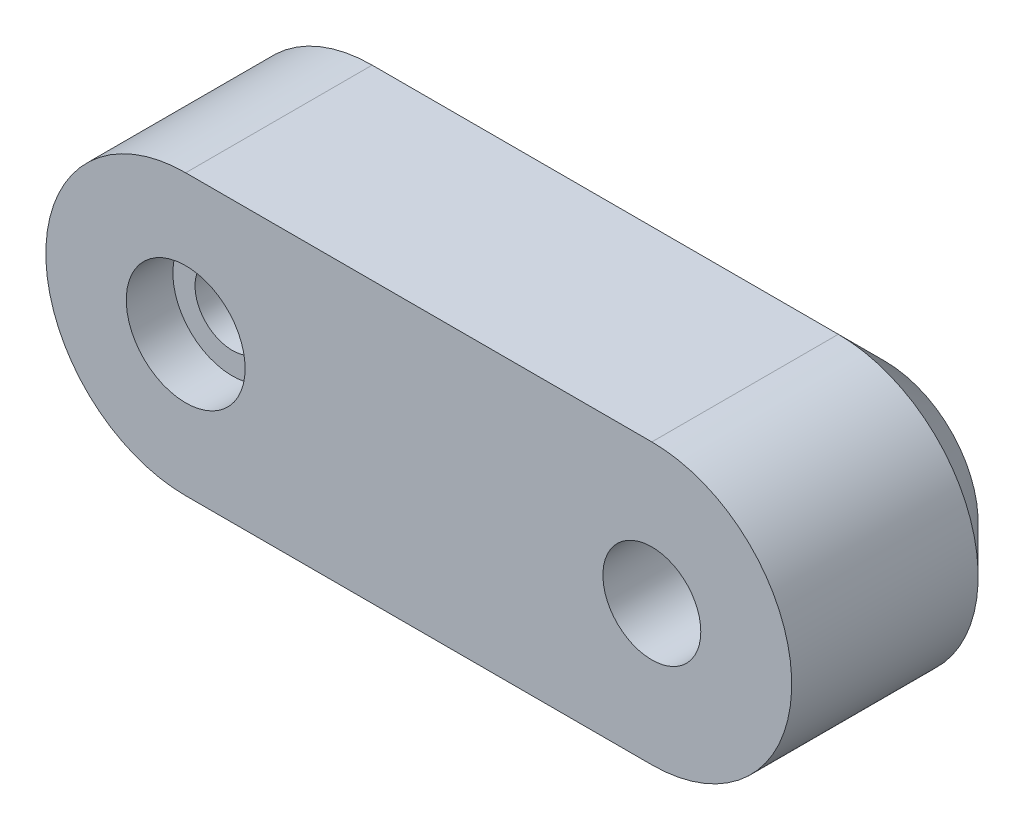
ISO-10303-21;
HEADER;
FILE_DESCRIPTION(('STEP AP214'),'2;1');
FILE_NAME('part.step','',(''),(''),'','','');
FILE_SCHEMA(('AUTOMOTIVE_DESIGN { 1 0 10303 214 1 1 1 1 }'));
ENDSEC;
DATA;
#1=APPLICATION_CONTEXT('core data for automotive mechanical design processes');
#2=APPLICATION_PROTOCOL_DEFINITION('international standard','automotive_design',2000,#1);
#3=PRODUCT_CONTEXT('',#1,'mechanical');
#4=PRODUCT('Part','Part','',(#3));
#5=PRODUCT_RELATED_PRODUCT_CATEGORY('part','',(#4));
#6=PRODUCT_DEFINITION_FORMATION('','',#4);
#7=PRODUCT_DEFINITION_CONTEXT('part definition',#1,'design');
#8=PRODUCT_DEFINITION('design','',#6,#7);
#9=PRODUCT_DEFINITION_SHAPE('','',#8);
#10=(LENGTH_UNIT() NAMED_UNIT(*) SI_UNIT(.MILLI.,.METRE.));
#11=(NAMED_UNIT(*) PLANE_ANGLE_UNIT() SI_UNIT($,.RADIAN.));
#12=(NAMED_UNIT(*) SI_UNIT($,.STERADIAN.) SOLID_ANGLE_UNIT());
#13=UNCERTAINTY_MEASURE_WITH_UNIT(LENGTH_MEASURE(1.E-05),#10,'distance_accuracy_value','');
#14=(GEOMETRIC_REPRESENTATION_CONTEXT(3) GLOBAL_UNCERTAINTY_ASSIGNED_CONTEXT((#13)) GLOBAL_UNIT_ASSIGNED_CONTEXT((#10,
#11,#12)) REPRESENTATION_CONTEXT('',''));
#15=CARTESIAN_POINT('',(0.,0.,0.));
#16=DIRECTION('',(0.,0.,1.));
#17=DIRECTION('',(1.,0.,0.));
#18=AXIS2_PLACEMENT_3D('',#15,#16,#17);
#19=CARTESIAN_POINT('',(20.,0.,10.));
#20=DIRECTION('',(0.,0.,1.));
#21=DIRECTION('',(1.,0.,0.));
#22=AXIS2_PLACEMENT_3D('',#19,#20,#21);
#23=CYLINDRICAL_SURFACE('',#22,2.58);
#24=CARTESIAN_POINT('',(20.,0.,5.));
#25=DIRECTION('',(0.,0.,1.));
#26=DIRECTION('',(1.,0.,0.));
#27=AXIS2_PLACEMENT_3D('',#24,#25,#26);
#28=CIRCLE('',#27,2.58);
#29=CARTESIAN_POINT('',(22.58,0.,5.));
#30=VERTEX_POINT('',#29);
#31=EDGE_CURVE('E185',#30,#30,#28,.T.);
#32=ORIENTED_EDGE('',*,*,#31,.T.);
#33=EDGE_LOOP('',(#32));
#34=FACE_BOUND('',#33,.T.);
#35=CARTESIAN_POINT('',(20.,0.,4.));
#36=DIRECTION('',(0.,0.,-1.));
#37=DIRECTION('',(-1.,0.,0.));
#38=AXIS2_PLACEMENT_3D('',#35,#36,#37);
#39=CIRCLE('',#38,2.58);
#40=CARTESIAN_POINT('',(17.42,0.,4.));
#41=VERTEX_POINT('',#40);
#42=EDGE_CURVE('E37',#41,#41,#39,.T.);
#43=ORIENTED_EDGE('',*,*,#42,.T.);
#44=EDGE_LOOP('',(#43));
#45=FACE_BOUND('',#44,.T.);
#46=ADVANCED_FACE('F33',(#34,#45),#23,.F.);
#47=CARTESIAN_POINT('',(0.,0.,10.));
#48=DIRECTION('',(0.,0.,-1.));
#49=DIRECTION('',(-1.,0.,0.));
#50=AXIS2_PLACEMENT_3D('',#47,#48,#49);
#51=CYLINDRICAL_SURFACE('',#50,6.);
#52=DIRECTION('',(0.,0.,-1.));
#53=VECTOR('',#52,1.);
#54=CARTESIAN_POINT('',(0.,6.,10.));
#55=LINE('',#54,#53);
#56=CARTESIAN_POINT('',(0.,6.,10.));
#57=VERTEX_POINT('',#56);
#58=CARTESIAN_POINT('',(0.,6.,2.00000000000001));
#59=VERTEX_POINT('',#58);
#60=EDGE_CURVE('E215',#57,#59,#55,.T.);
#61=ORIENTED_EDGE('',*,*,#60,.T.);
#62=CARTESIAN_POINT('',(0.,0.,2.00000000000001));
#63=DIRECTION('',(0.,0.,1.));
#64=DIRECTION('',(1.,0.,0.));
#65=AXIS2_PLACEMENT_3D('',#62,#63,#64);
#66=CIRCLE('',#65,6.);
#67=CARTESIAN_POINT('',(0.,-6.,2.00000000000001));
#68=VERTEX_POINT('',#67);
#69=EDGE_CURVE('E237',#59,#68,#66,.T.);
#70=ORIENTED_EDGE('',*,*,#69,.T.);
#71=DIRECTION('',(0.,0.,-1.));
#72=VECTOR('',#71,1.);
#73=CARTESIAN_POINT('',(0.,-6.,10.));
#74=LINE('',#73,#72);
#75=CARTESIAN_POINT('',(0.,-6.,10.));
#76=VERTEX_POINT('',#75);
#77=EDGE_CURVE('E223',#76,#68,#74,.T.);
#78=ORIENTED_EDGE('',*,*,#77,.F.);
#79=CARTESIAN_POINT('',(0.,0.,10.));
#80=DIRECTION('',(0.,0.,1.));
#81=DIRECTION('',(1.,0.,0.));
#82=AXIS2_PLACEMENT_3D('',#79,#80,#81);
#83=CIRCLE('',#82,6.);
#84=EDGE_CURVE('E206',#57,#76,#83,.T.);
#85=ORIENTED_EDGE('',*,*,#84,.F.);
#86=EDGE_LOOP('',(#61,#70,#78,#85));
#87=FACE_BOUND('',#86,.T.);
#88=ADVANCED_FACE('F276',(#87),#51,.T.);
#89=CARTESIAN_POINT('',(0.,-6.,10.));
#90=DIRECTION('',(0.,1.,0.));
#91=DIRECTION('',(-1.,0.,0.));
#92=AXIS2_PLACEMENT_3D('',#89,#90,#91);
#93=PLANE('',#92);
#94=ORIENTED_EDGE('',*,*,#77,.T.);
#95=DIRECTION('',(1.,0.,0.));
#96=VECTOR('',#95,1.);
#97=CARTESIAN_POINT('',(0.,-6.,2.00000000000001));
#98=LINE('',#97,#96);
#99=CARTESIAN_POINT('',(20.,-6.,2.00000000000001));
#100=VERTEX_POINT('',#99);
#101=EDGE_CURVE('E11',#68,#100,#98,.T.);
#102=ORIENTED_EDGE('',*,*,#101,.T.);
#103=DIRECTION('',(0.,0.,-1.));
#104=VECTOR('',#103,1.);
#105=CARTESIAN_POINT('',(20.,-6.,10.));
#106=LINE('',#105,#104);
#107=CARTESIAN_POINT('',(20.,-6.,10.));
#108=VERTEX_POINT('',#107);
#109=EDGE_CURVE('E221',#108,#100,#106,.T.);
#110=ORIENTED_EDGE('',*,*,#109,.F.);
#111=DIRECTION('',(1.,0.,0.));
#112=VECTOR('',#111,1.);
#113=CARTESIAN_POINT('',(0.,-6.,10.));
#114=LINE('',#113,#112);
#115=EDGE_CURVE('E209',#76,#108,#114,.T.);
#116=ORIENTED_EDGE('',*,*,#115,.F.);
#117=EDGE_LOOP('',(#94,#102,#110,#116));
#118=FACE_BOUND('',#117,.T.);
#119=ADVANCED_FACE('F282',(#118),#93,.F.);
#120=CARTESIAN_POINT('',(20.,0.,10.));
#121=DIRECTION('',(0.,0.,-1.));
#122=DIRECTION('',(-1.,0.,0.));
#123=AXIS2_PLACEMENT_3D('',#120,#121,#122);
#124=CYLINDRICAL_SURFACE('',#123,6.);
#125=ORIENTED_EDGE('',*,*,#109,.T.);
#126=CARTESIAN_POINT('',(20.,0.,2.00000000000001));
#127=DIRECTION('',(0.,0.,1.));
#128=DIRECTION('',(1.,0.,0.));
#129=AXIS2_PLACEMENT_3D('',#126,#127,#128);
#130=CIRCLE('',#129,6.);
#131=CARTESIAN_POINT('',(20.,6.,2.00000000000001));
#132=VERTEX_POINT('',#131);
#133=EDGE_CURVE('E42',#100,#132,#130,.T.);
#134=ORIENTED_EDGE('',*,*,#133,.T.);
#135=DIRECTION('',(0.,0.,-1.));
#136=VECTOR('',#135,1.);
#137=CARTESIAN_POINT('',(20.,6.,10.));
#138=LINE('',#137,#136);
#139=CARTESIAN_POINT('',(20.,6.,10.));
#140=VERTEX_POINT('',#139);
#141=EDGE_CURVE('E218',#140,#132,#138,.T.);
#142=ORIENTED_EDGE('',*,*,#141,.F.);
#143=CARTESIAN_POINT('',(20.,0.,10.));
#144=DIRECTION('',(0.,0.,1.));
#145=DIRECTION('',(1.,0.,0.));
#146=AXIS2_PLACEMENT_3D('',#143,#144,#145);
#147=CIRCLE('',#146,6.);
#148=EDGE_CURVE('E211',#108,#140,#147,.T.);
#149=ORIENTED_EDGE('',*,*,#148,.F.);
#150=EDGE_LOOP('',(#125,#134,#142,#149));
#151=FACE_BOUND('',#150,.T.);
#152=ADVANCED_FACE('F281',(#151),#124,.T.);
#153=CARTESIAN_POINT('',(0.,6.,10.));
#154=DIRECTION('',(0.,-1.,0.));
#155=DIRECTION('',(1.,0.,0.));
#156=AXIS2_PLACEMENT_3D('',#153,#154,#155);
#157=PLANE('',#156);
#158=ORIENTED_EDGE('',*,*,#141,.T.);
#159=DIRECTION('',(-1.,0.,0.));
#160=VECTOR('',#159,1.);
#161=CARTESIAN_POINT('',(0.,6.,2.00000000000001));
#162=LINE('',#161,#160);
#163=EDGE_CURVE('E225',#132,#59,#162,.T.);
#164=ORIENTED_EDGE('',*,*,#163,.T.);
#165=ORIENTED_EDGE('',*,*,#60,.F.);
#166=DIRECTION('',(-1.,0.,0.));
#167=VECTOR('',#166,1.);
#168=CARTESIAN_POINT('',(0.,6.,10.));
#169=LINE('',#168,#167);
#170=EDGE_CURVE('E213',#140,#57,#169,.T.);
#171=ORIENTED_EDGE('',*,*,#170,.F.);
#172=EDGE_LOOP('',(#158,#164,#165,#171));
#173=FACE_BOUND('',#172,.T.);
#174=ADVANCED_FACE('F272',(#173),#157,.F.);
#175=CARTESIAN_POINT('',(0.,0.,10.));
#176=DIRECTION('',(0.,0.,1.));
#177=DIRECTION('',(1.,0.,0.));
#178=AXIS2_PLACEMENT_3D('',#175,#176,#177);
#179=PLANE('',#178);
#180=CARTESIAN_POINT('',(20.,0.,10.));
#181=DIRECTION('',(0.,0.,1.));
#182=DIRECTION('',(1.,0.,0.));
#183=AXIS2_PLACEMENT_3D('',#180,#181,#182);
#184=CIRCLE('',#183,2.1);
#185=CARTESIAN_POINT('',(22.1,0.,10.));
#186=VERTEX_POINT('',#185);
#187=EDGE_CURVE('E178',#186,#186,#184,.T.);
#188=ORIENTED_EDGE('',*,*,#187,.F.);
#189=EDGE_LOOP('',(#188));
#190=FACE_BOUND('',#189,.T.);
#191=CARTESIAN_POINT('',(0.,0.,10.));
#192=DIRECTION('',(0.,0.,1.));
#193=DIRECTION('',(1.,0.,0.));
#194=AXIS2_PLACEMENT_3D('',#191,#192,#193);
#195=CIRCLE('',#194,2.55);
#196=CARTESIAN_POINT('',(2.55,0.,10.));
#197=VERTEX_POINT('',#196);
#198=EDGE_CURVE('E188',#197,#197,#195,.T.);
#199=ORIENTED_EDGE('',*,*,#198,.F.);
#200=EDGE_LOOP('',(#199));
#201=FACE_BOUND('',#200,.T.);
#202=ORIENTED_EDGE('',*,*,#84,.T.);
#203=ORIENTED_EDGE('',*,*,#115,.T.);
#204=ORIENTED_EDGE('',*,*,#148,.T.);
#205=ORIENTED_EDGE('',*,*,#170,.T.);
#206=EDGE_LOOP('',(#202,#203,#204,#205));
#207=FACE_BOUND('',#206,.T.);
#208=ADVANCED_FACE('F278',(#190,#201,#207),#179,.T.);
#209=CARTESIAN_POINT('',(0.,0.,0.));
#210=DIRECTION('',(0.,0.,1.));
#211=DIRECTION('',(1.,0.,0.));
#212=AXIS2_PLACEMENT_3D('',#209,#210,#211);
#213=PLANE('',#212);
#214=DIRECTION('',(-0.5,-0.866025403784438,0.));
#215=VECTOR('',#214,1.);
#216=CARTESIAN_POINT('',(23.3486315612998,0.,0.));
#217=LINE('',#216,#215);
#218=CARTESIAN_POINT('',(23.3486315612998,0.,0.));
#219=VERTEX_POINT('',#218);
#220=CARTESIAN_POINT('',(21.6743157806499,-2.9,0.));
#221=VERTEX_POINT('',#220);
#222=EDGE_CURVE('E159',#219,#221,#217,.T.);
#223=ORIENTED_EDGE('',*,*,#222,.F.);
#224=DIRECTION('',(0.500000000000001,-0.866025403784438,0.));
#225=VECTOR('',#224,1.);
#226=CARTESIAN_POINT('',(21.6743157806499,2.9,0.));
#227=LINE('',#226,#225);
#228=CARTESIAN_POINT('',(21.6743157806499,2.9,0.));
#229=VERTEX_POINT('',#228);
#230=EDGE_CURVE('E50',#229,#219,#227,.T.);
#231=ORIENTED_EDGE('',*,*,#230,.F.);
#232=DIRECTION('',(1.,0.,0.));
#233=VECTOR('',#232,1.);
#234=CARTESIAN_POINT('',(18.3256842193501,2.9,0.));
#235=LINE('',#234,#233);
#236=CARTESIAN_POINT('',(18.3256842193501,2.9,0.));
#237=VERTEX_POINT('',#236);
#238=EDGE_CURVE('E145',#237,#229,#235,.T.);
#239=ORIENTED_EDGE('',*,*,#238,.F.);
#240=DIRECTION('',(0.5,0.866025403784439,0.));
#241=VECTOR('',#240,1.);
#242=CARTESIAN_POINT('',(16.6513684387002,0.,0.));
#243=LINE('',#242,#241);
#244=CARTESIAN_POINT('',(16.6513684387002,0.,0.));
#245=VERTEX_POINT('',#244);
#246=EDGE_CURVE('E148',#245,#237,#243,.T.);
#247=ORIENTED_EDGE('',*,*,#246,.F.);
#248=DIRECTION('',(-0.5,0.866025403784438,0.));
#249=VECTOR('',#248,1.);
#250=CARTESIAN_POINT('',(18.3256842193501,-2.9,0.));
#251=LINE('',#250,#249);
#252=CARTESIAN_POINT('',(18.3256842193501,-2.9,0.));
#253=VERTEX_POINT('',#252);
#254=EDGE_CURVE('E164',#253,#245,#251,.T.);
#255=ORIENTED_EDGE('',*,*,#254,.F.);
#256=DIRECTION('',(-1.,0.,0.));
#257=VECTOR('',#256,1.);
#258=CARTESIAN_POINT('',(21.6743157806499,-2.9,0.));
#259=LINE('',#258,#257);
#260=EDGE_CURVE('E161',#221,#253,#259,.T.);
#261=ORIENTED_EDGE('',*,*,#260,.F.);
#262=EDGE_LOOP('',(#223,#231,#239,#247,#255,#261));
#263=FACE_BOUND('',#262,.T.);
#264=CARTESIAN_POINT('',(0.,0.,0.));
#265=DIRECTION('',(0.,0.,1.));
#266=DIRECTION('',(1.,0.,0.));
#267=AXIS2_PLACEMENT_3D('',#264,#265,#266);
#268=CIRCLE('',#267,4.);
#269=CARTESIAN_POINT('',(0.,-4.,0.));
#270=VERTEX_POINT('',#269);
#271=CARTESIAN_POINT('',(0.,4.,0.));
#272=VERTEX_POINT('',#271);
#273=EDGE_CURVE('E232',#270,#272,#268,.F.);
#274=ORIENTED_EDGE('',*,*,#273,.T.);
#275=DIRECTION('',(1.,0.,0.));
#276=VECTOR('',#275,1.);
#277=CARTESIAN_POINT('',(0.,4.,0.));
#278=LINE('',#277,#276);
#279=CARTESIAN_POINT('',(20.,4.,0.));
#280=VERTEX_POINT('',#279);
#281=EDGE_CURVE('E234',#272,#280,#278,.T.);
#282=ORIENTED_EDGE('',*,*,#281,.T.);
#283=CARTESIAN_POINT('',(20.,0.,0.));
#284=DIRECTION('',(0.,0.,1.));
#285=DIRECTION('',(1.,0.,0.));
#286=AXIS2_PLACEMENT_3D('',#283,#284,#285);
#287=CIRCLE('',#286,4.);
#288=CARTESIAN_POINT('',(20.,-4.,0.));
#289=VERTEX_POINT('',#288);
#290=EDGE_CURVE('E230',#280,#289,#287,.F.);
#291=ORIENTED_EDGE('',*,*,#290,.T.);
#292=DIRECTION('',(-1.,0.,0.));
#293=VECTOR('',#292,1.);
#294=CARTESIAN_POINT('',(0.,-4.,0.));
#295=LINE('',#294,#293);
#296=EDGE_CURVE('E228',#289,#270,#295,.T.);
#297=ORIENTED_EDGE('',*,*,#296,.T.);
#298=EDGE_LOOP('',(#274,#282,#291,#297));
#299=FACE_BOUND('',#298,.T.);
#300=CARTESIAN_POINT('',(0.,0.,0.));
#301=DIRECTION('',(0.,0.,1.));
#302=DIRECTION('',(1.,0.,0.));
#303=AXIS2_PLACEMENT_3D('',#300,#301,#302);
#304=CIRCLE('',#303,2.55);
#305=CARTESIAN_POINT('',(2.55,0.,0.));
#306=VERTEX_POINT('',#305);
#307=EDGE_CURVE('E203',#306,#306,#304,.T.);
#308=ORIENTED_EDGE('',*,*,#307,.T.);
#309=EDGE_LOOP('',(#308));
#310=FACE_BOUND('',#309,.T.);
#311=ADVANCED_FACE('F258',(#263,#299,#310),#213,.F.);
#312=CARTESIAN_POINT('',(0.,0.,10.));
#313=DIRECTION('',(0.,0.,1.));
#314=DIRECTION('',(1.,0.,0.));
#315=AXIS2_PLACEMENT_3D('',#312,#313,#314);
#316=CYLINDRICAL_SURFACE('',#315,2.55);
#317=CARTESIAN_POINT('',(0.,0.,5.));
#318=DIRECTION('',(0.,0.,1.));
#319=DIRECTION('',(1.,0.,0.));
#320=AXIS2_PLACEMENT_3D('',#317,#318,#319);
#321=CIRCLE('',#320,2.55);
#322=CARTESIAN_POINT('',(2.55,0.,5.));
#323=VERTEX_POINT('',#322);
#324=EDGE_CURVE('E200',#323,#323,#321,.T.);
#325=ORIENTED_EDGE('',*,*,#324,.T.);
#326=EDGE_LOOP('',(#325));
#327=FACE_BOUND('',#326,.T.);
#328=ORIENTED_EDGE('',*,*,#307,.F.);
#329=EDGE_LOOP('',(#328));
#330=FACE_BOUND('',#329,.T.);
#331=ADVANCED_FACE('F316',(#327,#330),#316,.F.);
#332=CARTESIAN_POINT('',(-2.55,0.,5.));
#333=DIRECTION('',(0.,0.,-1.));
#334=DIRECTION('',(-1.,0.,0.));
#335=AXIS2_PLACEMENT_3D('',#332,#333,#334);
#336=PLANE('',#335);
#337=CARTESIAN_POINT('',(0.,0.,5.));
#338=DIRECTION('',(0.,0.,1.));
#339=DIRECTION('',(1.,0.,0.));
#340=AXIS2_PLACEMENT_3D('',#337,#338,#339);
#341=CIRCLE('',#340,1.6);
#342=CARTESIAN_POINT('',(1.6,0.,5.));
#343=VERTEX_POINT('',#342);
#344=EDGE_CURVE('E197',#343,#343,#341,.T.);
#345=ORIENTED_EDGE('',*,*,#344,.T.);
#346=EDGE_LOOP('',(#345));
#347=FACE_BOUND('',#346,.T.);
#348=ORIENTED_EDGE('',*,*,#324,.F.);
#349=EDGE_LOOP('',(#348));
#350=FACE_BOUND('',#349,.T.);
#351=ADVANCED_FACE('F312',(#347,#350),#336,.T.);
#352=CARTESIAN_POINT('',(0.,0.,10.));
#353=DIRECTION('',(0.,0.,1.));
#354=DIRECTION('',(1.,0.,0.));
#355=AXIS2_PLACEMENT_3D('',#352,#353,#354);
#356=CYLINDRICAL_SURFACE('',#355,1.6);
#357=CARTESIAN_POINT('',(0.,0.,8.));
#358=DIRECTION('',(0.,0.,1.));
#359=DIRECTION('',(1.,0.,0.));
#360=AXIS2_PLACEMENT_3D('',#357,#358,#359);
#361=CIRCLE('',#360,1.6);
#362=CARTESIAN_POINT('',(1.6,0.,8.));
#363=VERTEX_POINT('',#362);
#364=EDGE_CURVE('E194',#363,#363,#361,.T.);
#365=ORIENTED_EDGE('',*,*,#364,.T.);
#366=EDGE_LOOP('',(#365));
#367=FACE_BOUND('',#366,.T.);
#368=ORIENTED_EDGE('',*,*,#344,.F.);
#369=EDGE_LOOP('',(#368));
#370=FACE_BOUND('',#369,.T.);
#371=ADVANCED_FACE('F308',(#367,#370),#356,.F.);
#372=CARTESIAN_POINT('',(-1.6,0.,8.));
#373=DIRECTION('',(0.,0.,1.));
#374=DIRECTION('',(1.,0.,0.));
#375=AXIS2_PLACEMENT_3D('',#372,#373,#374);
#376=PLANE('',#375);
#377=CARTESIAN_POINT('',(0.,0.,8.));
#378=DIRECTION('',(0.,0.,1.));
#379=DIRECTION('',(1.,0.,0.));
#380=AXIS2_PLACEMENT_3D('',#377,#378,#379);
#381=CIRCLE('',#380,2.55);
#382=CARTESIAN_POINT('',(2.55,0.,8.));
#383=VERTEX_POINT('',#382);
#384=EDGE_CURVE('E191',#383,#383,#381,.T.);
#385=ORIENTED_EDGE('',*,*,#384,.T.);
#386=EDGE_LOOP('',(#385));
#387=FACE_BOUND('',#386,.T.);
#388=ORIENTED_EDGE('',*,*,#364,.F.);
#389=EDGE_LOOP('',(#388));
#390=FACE_BOUND('',#389,.T.);
#391=ADVANCED_FACE('F304',(#387,#390),#376,.T.);
#392=CARTESIAN_POINT('',(0.,0.,10.));
#393=DIRECTION('',(0.,0.,1.));
#394=DIRECTION('',(1.,0.,0.));
#395=AXIS2_PLACEMENT_3D('',#392,#393,#394);
#396=CYLINDRICAL_SURFACE('',#395,2.55);
#397=ORIENTED_EDGE('',*,*,#198,.T.);
#398=EDGE_LOOP('',(#397));
#399=FACE_BOUND('',#398,.T.);
#400=ORIENTED_EDGE('',*,*,#384,.F.);
#401=EDGE_LOOP('',(#400));
#402=FACE_BOUND('',#401,.T.);
#403=ADVANCED_FACE('F301',(#399,#402),#396,.F.);
#404=CARTESIAN_POINT('',(17.42,0.,5.));
#405=DIRECTION('',(0.,0.,-1.));
#406=DIRECTION('',(-1.,0.,0.));
#407=AXIS2_PLACEMENT_3D('',#404,#405,#406);
#408=PLANE('',#407);
#409=CARTESIAN_POINT('',(20.,0.,5.));
#410=DIRECTION('',(0.,0.,1.));
#411=DIRECTION('',(1.,0.,0.));
#412=AXIS2_PLACEMENT_3D('',#409,#410,#411);
#413=CIRCLE('',#412,2.1);
#414=CARTESIAN_POINT('',(22.1,0.,5.));
#415=VERTEX_POINT('',#414);
#416=EDGE_CURVE('E181',#415,#415,#413,.T.);
#417=ORIENTED_EDGE('',*,*,#416,.T.);
#418=EDGE_LOOP('',(#417));
#419=FACE_BOUND('',#418,.T.);
#420=ORIENTED_EDGE('',*,*,#31,.F.);
#421=EDGE_LOOP('',(#420));
#422=FACE_BOUND('',#421,.T.);
#423=ADVANCED_FACE('F299',(#419,#422),#408,.T.);
#424=CARTESIAN_POINT('',(20.,0.,10.));
#425=DIRECTION('',(0.,0.,1.));
#426=DIRECTION('',(1.,0.,0.));
#427=AXIS2_PLACEMENT_3D('',#424,#425,#426);
#428=CYLINDRICAL_SURFACE('',#427,2.1);
#429=ORIENTED_EDGE('',*,*,#187,.T.);
#430=EDGE_LOOP('',(#429));
#431=FACE_BOUND('',#430,.T.);
#432=ORIENTED_EDGE('',*,*,#416,.F.);
#433=EDGE_LOOP('',(#432));
#434=FACE_BOUND('',#433,.T.);
#435=ADVANCED_FACE('F368',(#431,#434),#428,.F.);
#436=CARTESIAN_POINT('',(0.,-6.,2.00000000000001));
#437=DIRECTION('',(0.,0.707106781186549,0.707106781186546));
#438=DIRECTION('',(1.,0.,0.));
#439=AXIS2_PLACEMENT_3D('',#436,#437,#438);
#440=PLANE('',#439);
#441=DIRECTION('',(0.,-0.707106781186546,0.707106781186549));
#442=VECTOR('',#441,1.);
#443=CARTESIAN_POINT('',(0.,-4.,0.));
#444=LINE('',#443,#442);
#445=EDGE_CURVE('E244',#270,#68,#444,.T.);
#446=ORIENTED_EDGE('',*,*,#445,.F.);
#447=ORIENTED_EDGE('',*,*,#296,.F.);
#448=DIRECTION('',(0.,0.707106781186546,-0.707106781186549));
#449=VECTOR('',#448,1.);
#450=CARTESIAN_POINT('',(20.,-6.,2.00000000000001));
#451=LINE('',#450,#449);
#452=EDGE_CURVE('E182',#100,#289,#451,.T.);
#453=ORIENTED_EDGE('',*,*,#452,.F.);
#454=ORIENTED_EDGE('',*,*,#101,.F.);
#455=EDGE_LOOP('',(#446,#447,#453,#454));
#456=FACE_BOUND('',#455,.T.);
#457=ADVANCED_FACE('F35',(#456),#440,.F.);
#458=CARTESIAN_POINT('',(20.,0.,2.00000000000001));
#459=DIRECTION('',(0.,0.,1.));
#460=DIRECTION('',(1.,0.,0.));
#461=AXIS2_PLACEMENT_3D('',#458,#459,#460);
#462=CONICAL_SURFACE('',#461,6.,0.785398163397447);
#463=ORIENTED_EDGE('',*,*,#452,.T.);
#464=ORIENTED_EDGE('',*,*,#290,.F.);
#465=DIRECTION('',(0.,-0.707106781186546,-0.707106781186549));
#466=VECTOR('',#465,1.);
#467=CARTESIAN_POINT('',(20.,6.,2.00000000000001));
#468=LINE('',#467,#466);
#469=EDGE_CURVE('E242',#132,#280,#468,.T.);
#470=ORIENTED_EDGE('',*,*,#469,.F.);
#471=ORIENTED_EDGE('',*,*,#133,.F.);
#472=EDGE_LOOP('',(#463,#464,#470,#471));
#473=FACE_BOUND('',#472,.T.);
#474=ADVANCED_FACE('F251',(#473),#462,.T.);
#475=CARTESIAN_POINT('',(0.,0.,2.00000000000001));
#476=DIRECTION('',(0.,0.,1.));
#477=DIRECTION('',(1.,0.,0.));
#478=AXIS2_PLACEMENT_3D('',#475,#476,#477);
#479=CONICAL_SURFACE('',#478,6.,0.785398163397447);
#480=ORIENTED_EDGE('',*,*,#445,.T.);
#481=ORIENTED_EDGE('',*,*,#69,.F.);
#482=DIRECTION('',(0.,0.707106781186546,0.707106781186549));
#483=VECTOR('',#482,1.);
#484=CARTESIAN_POINT('',(0.,4.,0.));
#485=LINE('',#484,#483);
#486=EDGE_CURVE('E240',#272,#59,#485,.T.);
#487=ORIENTED_EDGE('',*,*,#486,.F.);
#488=ORIENTED_EDGE('',*,*,#273,.F.);
#489=EDGE_LOOP('',(#480,#481,#487,#488));
#490=FACE_BOUND('',#489,.T.);
#491=ADVANCED_FACE('F267',(#490),#479,.T.);
#492=CARTESIAN_POINT('',(0.,6.,2.00000000000001));
#493=DIRECTION('',(0.,-0.707106781186549,0.707106781186546));
#494=DIRECTION('',(-1.,0.,0.));
#495=AXIS2_PLACEMENT_3D('',#492,#493,#494);
#496=PLANE('',#495);
#497=ORIENTED_EDGE('',*,*,#469,.T.);
#498=ORIENTED_EDGE('',*,*,#281,.F.);
#499=ORIENTED_EDGE('',*,*,#486,.T.);
#500=ORIENTED_EDGE('',*,*,#163,.F.);
#501=EDGE_LOOP('',(#497,#498,#499,#500));
#502=FACE_BOUND('',#501,.T.);
#503=ADVANCED_FACE('F263',(#502),#496,.F.);
#504=CARTESIAN_POINT('',(21.6743157806499,2.9,4.));
#505=DIRECTION('',(0.866025403784438,0.500000000000001,0.));
#506=DIRECTION('',(-0.500000000000001,0.866025403784438,0.));
#507=AXIS2_PLACEMENT_3D('',#504,#505,#506);
#508=PLANE('',#507);
#509=ORIENTED_EDGE('',*,*,#230,.T.);
#510=DIRECTION('',(0.,0.,-1.));
#511=VECTOR('',#510,1.);
#512=CARTESIAN_POINT('',(23.3486315612998,0.,4.));
#513=LINE('',#512,#511);
#514=CARTESIAN_POINT('',(23.3486315612998,0.,4.));
#515=VERTEX_POINT('',#514);
#516=EDGE_CURVE('E122',#515,#219,#513,.T.);
#517=ORIENTED_EDGE('',*,*,#516,.F.);
#518=DIRECTION('',(0.500000000000001,-0.866025403784438,0.));
#519=VECTOR('',#518,1.);
#520=CARTESIAN_POINT('',(21.6743157806499,2.9,4.));
#521=LINE('',#520,#519);
#522=CARTESIAN_POINT('',(21.6743157806499,2.9,4.));
#523=VERTEX_POINT('',#522);
#524=EDGE_CURVE('E126',#523,#515,#521,.T.);
#525=ORIENTED_EDGE('',*,*,#524,.F.);
#526=DIRECTION('',(0.,0.,-1.));
#527=VECTOR('',#526,1.);
#528=CARTESIAN_POINT('',(21.6743157806499,2.9,4.));
#529=LINE('',#528,#527);
#530=EDGE_CURVE('E169',#523,#229,#529,.T.);
#531=ORIENTED_EDGE('',*,*,#530,.T.);
#532=EDGE_LOOP('',(#509,#517,#525,#531));
#533=FACE_BOUND('',#532,.T.);
#534=ADVANCED_FACE('F124',(#533),#508,.F.);
#535=CARTESIAN_POINT('',(18.3256842193501,2.9,4.));
#536=DIRECTION('',(0.,1.,0.));
#537=DIRECTION('',(0.,0.,1.));
#538=AXIS2_PLACEMENT_3D('',#535,#536,#537);
#539=PLANE('',#538);
#540=ORIENTED_EDGE('',*,*,#238,.T.);
#541=ORIENTED_EDGE('',*,*,#530,.F.);
#542=DIRECTION('',(1.,0.,0.));
#543=VECTOR('',#542,1.);
#544=CARTESIAN_POINT('',(18.3256842193501,2.9,4.));
#545=LINE('',#544,#543);
#546=CARTESIAN_POINT('',(18.3256842193501,2.9,4.));
#547=VERTEX_POINT('',#546);
#548=EDGE_CURVE('E132',#547,#523,#545,.T.);
#549=ORIENTED_EDGE('',*,*,#548,.F.);
#550=DIRECTION('',(0.,0.,-1.));
#551=VECTOR('',#550,1.);
#552=CARTESIAN_POINT('',(18.3256842193501,2.9,4.));
#553=LINE('',#552,#551);
#554=EDGE_CURVE('E171',#547,#237,#553,.T.);
#555=ORIENTED_EDGE('',*,*,#554,.T.);
#556=EDGE_LOOP('',(#540,#541,#549,#555));
#557=FACE_BOUND('',#556,.T.);
#558=ADVANCED_FACE('F402',(#557),#539,.F.);
#559=CARTESIAN_POINT('',(16.6513684387002,0.,4.));
#560=DIRECTION('',(-0.866025403784439,0.5,0.));
#561=DIRECTION('',(-0.5,-0.866025403784439,0.));
#562=AXIS2_PLACEMENT_3D('',#559,#560,#561);
#563=PLANE('',#562);
#564=ORIENTED_EDGE('',*,*,#246,.T.);
#565=ORIENTED_EDGE('',*,*,#554,.F.);
#566=DIRECTION('',(0.5,0.866025403784439,0.));
#567=VECTOR('',#566,1.);
#568=CARTESIAN_POINT('',(16.6513684387002,0.,4.));
#569=LINE('',#568,#567);
#570=CARTESIAN_POINT('',(16.6513684387002,0.,4.));
#571=VERTEX_POINT('',#570);
#572=EDGE_CURVE('E155',#571,#547,#569,.T.);
#573=ORIENTED_EDGE('',*,*,#572,.F.);
#574=DIRECTION('',(0.,0.,-1.));
#575=VECTOR('',#574,1.);
#576=CARTESIAN_POINT('',(16.6513684387002,0.,4.));
#577=LINE('',#576,#575);
#578=EDGE_CURVE('E173',#571,#245,#577,.T.);
#579=ORIENTED_EDGE('',*,*,#578,.T.);
#580=EDGE_LOOP('',(#564,#565,#573,#579));
#581=FACE_BOUND('',#580,.T.);
#582=ADVANCED_FACE('F409',(#581),#563,.F.);
#583=CARTESIAN_POINT('',(18.3256842193501,-2.9,4.));
#584=DIRECTION('',(-0.866025403784439,-0.5,0.));
#585=DIRECTION('',(0.5,-0.866025403784438,0.));
#586=AXIS2_PLACEMENT_3D('',#583,#584,#585);
#587=PLANE('',#586);
#588=ORIENTED_EDGE('',*,*,#254,.T.);
#589=ORIENTED_EDGE('',*,*,#578,.F.);
#590=DIRECTION('',(-0.5,0.866025403784438,0.));
#591=VECTOR('',#590,1.);
#592=CARTESIAN_POINT('',(18.3256842193501,-2.9,4.));
#593=LINE('',#592,#591);
#594=CARTESIAN_POINT('',(18.3256842193501,-2.9,4.));
#595=VERTEX_POINT('',#594);
#596=EDGE_CURVE('E152',#595,#571,#593,.T.);
#597=ORIENTED_EDGE('',*,*,#596,.F.);
#598=DIRECTION('',(0.,0.,-1.));
#599=VECTOR('',#598,1.);
#600=CARTESIAN_POINT('',(18.3256842193501,-2.9,4.));
#601=LINE('',#600,#599);
#602=EDGE_CURVE('E175',#595,#253,#601,.T.);
#603=ORIENTED_EDGE('',*,*,#602,.T.);
#604=EDGE_LOOP('',(#588,#589,#597,#603));
#605=FACE_BOUND('',#604,.T.);
#606=ADVANCED_FACE('F417',(#605),#587,.F.);
#607=CARTESIAN_POINT('',(21.6743157806499,-2.9,4.));
#608=DIRECTION('',(0.,-1.,0.));
#609=DIRECTION('',(0.,0.,-1.));
#610=AXIS2_PLACEMENT_3D('',#607,#608,#609);
#611=PLANE('',#610);
#612=ORIENTED_EDGE('',*,*,#260,.T.);
#613=ORIENTED_EDGE('',*,*,#602,.F.);
#614=DIRECTION('',(-1.,0.,0.));
#615=VECTOR('',#614,1.);
#616=CARTESIAN_POINT('',(21.6743157806499,-2.9,4.));
#617=LINE('',#616,#615);
#618=CARTESIAN_POINT('',(21.6743157806499,-2.9,4.));
#619=VERTEX_POINT('',#618);
#620=EDGE_CURVE('E140',#619,#595,#617,.T.);
#621=ORIENTED_EDGE('',*,*,#620,.F.);
#622=DIRECTION('',(0.,0.,-1.));
#623=VECTOR('',#622,1.);
#624=CARTESIAN_POINT('',(21.6743157806499,-2.9,4.));
#625=LINE('',#624,#623);
#626=EDGE_CURVE('E131',#619,#221,#625,.T.);
#627=ORIENTED_EDGE('',*,*,#626,.T.);
#628=EDGE_LOOP('',(#612,#613,#621,#627));
#629=FACE_BOUND('',#628,.T.);
#630=ADVANCED_FACE('F425',(#629),#611,.F.);
#631=CARTESIAN_POINT('',(23.3486315612998,0.,4.));
#632=DIRECTION('',(0.866025403784438,-0.5,0.));
#633=DIRECTION('',(0.5,0.866025403784438,0.));
#634=AXIS2_PLACEMENT_3D('',#631,#632,#633);
#635=PLANE('',#634);
#636=ORIENTED_EDGE('',*,*,#222,.T.);
#637=ORIENTED_EDGE('',*,*,#626,.F.);
#638=DIRECTION('',(-0.5,-0.866025403784438,0.));
#639=VECTOR('',#638,1.);
#640=CARTESIAN_POINT('',(23.3486315612998,0.,4.));
#641=LINE('',#640,#639);
#642=EDGE_CURVE('E135',#515,#619,#641,.T.);
#643=ORIENTED_EDGE('',*,*,#642,.F.);
#644=ORIENTED_EDGE('',*,*,#516,.T.);
#645=EDGE_LOOP('',(#636,#637,#643,#644));
#646=FACE_BOUND('',#645,.T.);
#647=ADVANCED_FACE('F136',(#646),#635,.F.);
#648=CARTESIAN_POINT('',(0.,0.,4.));
#649=DIRECTION('',(0.,0.,-1.));
#650=DIRECTION('',(-1.,0.,0.));
#651=AXIS2_PLACEMENT_3D('',#648,#649,#650);
#652=PLANE('',#651);
#653=ORIENTED_EDGE('',*,*,#42,.F.);
#654=EDGE_LOOP('',(#653));
#655=FACE_BOUND('',#654,.T.);
#656=ORIENTED_EDGE('',*,*,#524,.T.);
#657=ORIENTED_EDGE('',*,*,#642,.T.);
#658=ORIENTED_EDGE('',*,*,#620,.T.);
#659=ORIENTED_EDGE('',*,*,#596,.T.);
#660=ORIENTED_EDGE('',*,*,#572,.T.);
#661=ORIENTED_EDGE('',*,*,#548,.T.);
#662=EDGE_LOOP('',(#656,#657,#658,#659,#660,#661));
#663=FACE_BOUND('',#662,.T.);
#664=ADVANCED_FACE('F142',(#655,#663),#652,.T.);
#665=CLOSED_SHELL('',(#46,#88,#119,#152,#174,#208,#311,#331,#351,#371,#391,#403,#423,#435,#457,
#474,#491,#503,#534,#558,#582,#606,#630,#647,#664));
#666=MANIFOLD_SOLID_BREP('B2',#665);
#667=ADVANCED_BREP_SHAPE_REPRESENTATION('',(#18,#666),#14);
#668=SHAPE_DEFINITION_REPRESENTATION(#9,#667);
ENDSEC;
END-ISO-10303-21;
